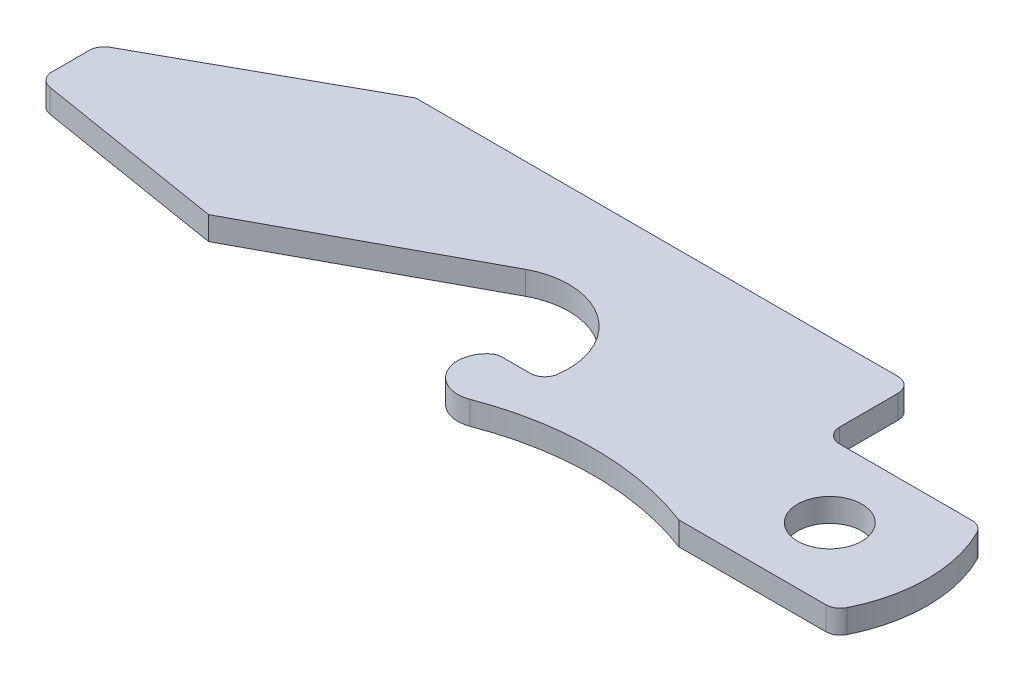
ISO-10303-21;
HEADER;
FILE_DESCRIPTION(('STEP AP214'),'2;1');
FILE_NAME('part.step','',(''),(''),'','','');
FILE_SCHEMA(('AUTOMOTIVE_DESIGN { 1 0 10303 214 1 1 1 1 }'));
ENDSEC;
DATA;
#1=APPLICATION_CONTEXT('core data for automotive mechanical design processes');
#2=APPLICATION_PROTOCOL_DEFINITION('international standard','automotive_design',2000,#1);
#3=PRODUCT_CONTEXT('',#1,'mechanical');
#4=PRODUCT('Part','Part','',(#3));
#5=PRODUCT_RELATED_PRODUCT_CATEGORY('part','',(#4));
#6=PRODUCT_DEFINITION_FORMATION('','',#4);
#7=PRODUCT_DEFINITION_CONTEXT('part definition',#1,'design');
#8=PRODUCT_DEFINITION('design','',#6,#7);
#9=PRODUCT_DEFINITION_SHAPE('','',#8);
#10=(LENGTH_UNIT() NAMED_UNIT(*) SI_UNIT(.MILLI.,.METRE.));
#11=(NAMED_UNIT(*) PLANE_ANGLE_UNIT() SI_UNIT($,.RADIAN.));
#12=(NAMED_UNIT(*) SI_UNIT($,.STERADIAN.) SOLID_ANGLE_UNIT());
#13=UNCERTAINTY_MEASURE_WITH_UNIT(LENGTH_MEASURE(1.E-05),#10,'distance_accuracy_value','');
#14=(GEOMETRIC_REPRESENTATION_CONTEXT(3) GLOBAL_UNCERTAINTY_ASSIGNED_CONTEXT((#13)) GLOBAL_UNIT_ASSIGNED_CONTEXT((#10,
#11,#12)) REPRESENTATION_CONTEXT('',''));
#15=CARTESIAN_POINT('',(0.,0.,0.));
#16=DIRECTION('',(0.,0.,1.));
#17=DIRECTION('',(1.,0.,0.));
#18=AXIS2_PLACEMENT_3D('',#15,#16,#17);
#19=CARTESIAN_POINT('',(19.2228019019053,1.016,1.93926605052077));
#20=DIRECTION('',(0.,-1.,0.));
#21=DIRECTION('',(0.,0.,-1.));
#22=AXIS2_PLACEMENT_3D('',#19,#20,#21);
#23=PLANE('',#22);
#24=DIRECTION('',(0.,0.,1.));
#25=VECTOR('',#24,1.);
#26=CARTESIAN_POINT('',(0.,1.016,0.));
#27=LINE('',#26,#25);
#28=CARTESIAN_POINT('',(0.,1.016,0.374379367879756));
#29=VERTEX_POINT('',#28);
#30=CARTESIAN_POINT('',(0.,1.016,2.00019421424728));
#31=VERTEX_POINT('',#30);
#32=EDGE_CURVE('E229',#29,#31,#27,.T.);
#33=ORIENTED_EDGE('',*,*,#32,.T.);
#34=CARTESIAN_POINT('',(0.635,1.016,2.00019421424728));
#35=DIRECTION('',(0.,-1.,0.));
#36=DIRECTION('',(0.,0.,-1.));
#37=AXIS2_PLACEMENT_3D('',#34,#35,#36);
#38=CIRCLE('',#37,0.635);
#39=CARTESIAN_POINT('',(0.532763489263101,1.016,2.62691001576527));
#40=VERTEX_POINT('',#39);
#41=EDGE_CURVE('E336',#31,#40,#38,.F.);
#42=ORIENTED_EDGE('',*,*,#41,.T.);
#43=DIRECTION('',(0.986954018138576,0.,0.161002379113226));
#44=VECTOR('',#43,1.);
#45=CARTESIAN_POINT('',(0.,1.016,2.54));
#46=LINE('',#45,#44);
#47=CARTESIAN_POINT('',(8.77402122125194,1.016,3.97131115031658));
#48=VERTEX_POINT('',#47);
#49=EDGE_CURVE('E233',#40,#48,#46,.T.);
#50=ORIENTED_EDGE('',*,*,#49,.T.);
#51=DIRECTION('',(0.879985795339902,0.,-0.475));
#52=VECTOR('',#51,1.);
#53=CARTESIAN_POINT('',(8.77402122125194,1.016,3.97131115031658));
#54=LINE('',#53,#52);
#55=CARTESIAN_POINT('',(17.7146769019053,1.016,-0.85468884968342));
#56=VERTEX_POINT('',#55);
#57=EDGE_CURVE('E235',#48,#56,#54,.T.);
#58=ORIENTED_EDGE('',*,*,#57,.T.);
#59=CARTESIAN_POINT('',(19.2228019019053,1.016,1.93926605052077));
#60=DIRECTION('',(0.,-1.,0.));
#61=DIRECTION('',(0.,0.,-1.));
#62=AXIS2_PLACEMENT_3D('',#59,#60,#61);
#63=CIRCLE('',#62,3.175);
#64=CARTESIAN_POINT('',(22.3618713878163,1.016,2.41557242526553));
#65=VERTEX_POINT('',#64);
#66=EDGE_CURVE('E237',#56,#65,#63,.T.);
#67=ORIENTED_EDGE('',*,*,#66,.T.);
#68=CARTESIAN_POINT('',(21.7340574906341,1.016,2.32031115031658));
#69=DIRECTION('',(0.,-1.,0.));
#70=DIRECTION('',(0.,0.,-1.));
#71=AXIS2_PLACEMENT_3D('',#68,#69,#70);
#72=CIRCLE('',#71,0.635);
#73=CARTESIAN_POINT('',(21.7340574906341,1.016,2.95531115031658));
#74=VERTEX_POINT('',#73);
#75=EDGE_CURVE('E376',#65,#74,#72,.T.);
#76=ORIENTED_EDGE('',*,*,#75,.T.);
#77=DIRECTION('',(-1.,0.,0.));
#78=VECTOR('',#77,1.);
#79=CARTESIAN_POINT('',(22.2308373663208,1.016,2.95531115031658));
#80=LINE('',#79,#78);
#81=CARTESIAN_POINT('',(20.5224710359564,1.016,2.95531115031658));
#82=VERTEX_POINT('',#81);
#83=EDGE_CURVE('E240',#74,#82,#80,.T.);
#84=ORIENTED_EDGE('',*,*,#83,.T.);
#85=CARTESIAN_POINT('',(20.5224710359564,1.016,3.59031115031658));
#86=DIRECTION('',(0.,-1.,0.));
#87=DIRECTION('',(0.,0.,-1.));
#88=AXIS2_PLACEMENT_3D('',#85,#86,#87);
#89=CIRCLE('',#88,0.635);
#90=CARTESIAN_POINT('',(20.0897713505508,1.016,3.12555747120273));
#91=VERTEX_POINT('',#90);
#92=EDGE_CURVE('E331',#82,#91,#89,.F.);
#93=ORIENTED_EDGE('',*,*,#92,.T.);
#94=CARTESIAN_POINT('',(20.9551707213621,1.016,4.05506482943046));
#95=DIRECTION('',(0.,1.,0.));
#96=DIRECTION('',(0.,0.,1.));
#97=AXIS2_PLACEMENT_3D('',#94,#95,#96);
#98=CIRCLE('',#97,1.27000000000003);
#99=CARTESIAN_POINT('',(21.4087340203449,1.016,5.24131115031661));
#100=VERTEX_POINT('',#99);
#101=EDGE_CURVE('E243',#91,#100,#98,.T.);
#102=ORIENTED_EDGE('',*,*,#101,.T.);
#103=CARTESIAN_POINT('',(25.9443670101724,1.016,17.1037743591779));
#104=DIRECTION('',(0.,-1.,0.));
#105=DIRECTION('',(0.,0.,-1.));
#106=AXIS2_PLACEMENT_3D('',#103,#104,#105);
#107=CIRCLE('',#106,12.7);
#108=CARTESIAN_POINT('',(30.48,1.016,5.24131115031659));
#109=VERTEX_POINT('',#108);
#110=EDGE_CURVE('E245',#100,#109,#107,.T.);
#111=ORIENTED_EDGE('',*,*,#110,.T.);
#112=DIRECTION('',(1.,0.,0.));
#113=VECTOR('',#112,1.);
#114=CARTESIAN_POINT('',(30.48,1.016,5.24131115031659));
#115=LINE('',#114,#113);
#116=CARTESIAN_POINT('',(36.8695336701696,1.016,5.24131115031658));
#117=VERTEX_POINT('',#116);
#118=EDGE_CURVE('E247',#109,#117,#115,.T.);
#119=ORIENTED_EDGE('',*,*,#118,.T.);
#120=CARTESIAN_POINT('',(36.8695336701696,1.016,4.60631115031658));
#121=DIRECTION('',(0.,-1.,0.));
#122=DIRECTION('',(0.,0.,-1.));
#123=AXIS2_PLACEMENT_3D('',#120,#121,#122);
#124=CIRCLE('',#123,0.635);
#125=CARTESIAN_POINT('',(37.4383707446329,1.016,4.8885333725388));
#126=VERTEX_POINT('',#125);
#127=EDGE_CURVE('E327',#117,#126,#124,.F.);
#128=ORIENTED_EDGE('',*,*,#127,.T.);
#129=CARTESIAN_POINT('',(31.75,1.016,2.06631115031658));
#130=DIRECTION('',(0.,1.,0.));
#131=DIRECTION('',(0.,0.,1.));
#132=AXIS2_PLACEMENT_3D('',#129,#130,#131);
#133=CIRCLE('',#132,6.35);
#134=CARTESIAN_POINT('',(37.4383707446329,1.016,-0.755911071905647));
#135=VERTEX_POINT('',#134);
#136=EDGE_CURVE('E250',#126,#135,#133,.T.);
#137=ORIENTED_EDGE('',*,*,#136,.T.);
#138=CARTESIAN_POINT('',(36.8695336701696,1.016,-0.473688849683422));
#139=DIRECTION('',(0.,-1.,0.));
#140=DIRECTION('',(0.,0.,-1.));
#141=AXIS2_PLACEMENT_3D('',#138,#139,#140);
#142=CIRCLE('',#141,0.635);
#143=CARTESIAN_POINT('',(36.8695336701696,1.016,-1.10868884968342));
#144=VERTEX_POINT('',#143);
#145=EDGE_CURVE('E329',#135,#144,#142,.F.);
#146=ORIENTED_EDGE('',*,*,#145,.T.);
#147=DIRECTION('',(-1.,0.,0.));
#148=VECTOR('',#147,1.);
#149=CARTESIAN_POINT('',(37.2492613140312,1.016,-1.10868884968342));
#150=LINE('',#149,#148);
#151=CARTESIAN_POINT('',(31.115,1.016,-1.10868884968342));
#152=VERTEX_POINT('',#151);
#153=EDGE_CURVE('E253',#144,#152,#150,.T.);
#154=ORIENTED_EDGE('',*,*,#153,.T.);
#155=CARTESIAN_POINT('',(31.115,1.016,-1.74368884968342));
#156=DIRECTION('',(0.,-1.,0.));
#157=DIRECTION('',(0.,0.,-1.));
#158=AXIS2_PLACEMENT_3D('',#155,#156,#157);
#159=CIRCLE('',#158,0.635);
#160=CARTESIAN_POINT('',(30.48,1.016,-1.74368884968342));
#161=VERTEX_POINT('',#160);
#162=EDGE_CURVE('E372',#152,#161,#159,.T.);
#163=ORIENTED_EDGE('',*,*,#162,.T.);
#164=DIRECTION('',(0.,0.,-1.));
#165=VECTOR('',#164,1.);
#166=CARTESIAN_POINT('',(30.48,1.016,-1.10868884968342));
#167=LINE('',#166,#165);
#168=CARTESIAN_POINT('',(30.48,1.016,-4.28368884968342));
#169=VERTEX_POINT('',#168);
#170=EDGE_CURVE('E256',#161,#169,#167,.T.);
#171=ORIENTED_EDGE('',*,*,#170,.T.);
#172=CARTESIAN_POINT('',(29.845,1.016,-4.28368884968342));
#173=DIRECTION('',(0.,-1.,0.));
#174=DIRECTION('',(0.,0.,-1.));
#175=AXIS2_PLACEMENT_3D('',#172,#173,#174);
#176=CIRCLE('',#175,0.635);
#177=CARTESIAN_POINT('',(29.845,1.016,-4.91868884968342));
#178=VERTEX_POINT('',#177);
#179=EDGE_CURVE('E61',#169,#178,#176,.F.);
#180=ORIENTED_EDGE('',*,*,#179,.T.);
#181=DIRECTION('',(-1.,0.,0.));
#182=VECTOR('',#181,1.);
#183=CARTESIAN_POINT('',(30.48,1.016,-4.91868884968342));
#184=LINE('',#183,#182);
#185=CARTESIAN_POINT('',(8.89,1.016,-4.91868884968342));
#186=VERTEX_POINT('',#185);
#187=EDGE_CURVE('E258',#178,#186,#184,.T.);
#188=ORIENTED_EDGE('',*,*,#187,.T.);
#189=DIRECTION('',(-0.875,0.,0.484122918275927));
#190=VECTOR('',#189,1.);
#191=CARTESIAN_POINT('',(8.89,1.016,-4.91868884968342));
#192=LINE('',#191,#190);
#193=CARTESIAN_POINT('',(0.327581946894787,1.016,-0.181245632120244));
#194=VERTEX_POINT('',#193);
#195=EDGE_CURVE('E226',#186,#194,#192,.T.);
#196=ORIENTED_EDGE('',*,*,#195,.T.);
#197=CARTESIAN_POINT('',(0.635,1.016,0.374379367879756));
#198=DIRECTION('',(0.,-1.,0.));
#199=DIRECTION('',(0.,0.,-1.));
#200=AXIS2_PLACEMENT_3D('',#197,#198,#199);
#201=CIRCLE('',#200,0.635);
#202=EDGE_CURVE('E334',#194,#29,#201,.F.);
#203=ORIENTED_EDGE('',*,*,#202,.T.);
#204=EDGE_LOOP('',(#33,#42,#50,#58,#67,#76,#84,#93,#102,#111,#119,#128,#137,#146,#154,#163,#171,
#180,#188,#196,#203));
#205=FACE_BOUND('',#204,.T.);
#206=CARTESIAN_POINT('',(33.8646306570156,1.016,2.06631115031658));
#207=DIRECTION('',(0.,1.,0.));
#208=DIRECTION('',(0.,0.,1.));
#209=AXIS2_PLACEMENT_3D('',#206,#207,#208);
#210=CIRCLE('',#209,1.39700000000001);
#211=CARTESIAN_POINT('',(33.8646306570156,1.016,3.46331115031659));
#212=VERTEX_POINT('',#211);
#213=EDGE_CURVE('E220',#212,#212,#210,.T.);
#214=ORIENTED_EDGE('',*,*,#213,.F.);
#215=EDGE_LOOP('',(#214));
#216=FACE_BOUND('',#215,.T.);
#217=ADVANCED_FACE('F38',(#205,#216),#23,.F.);
#218=CARTESIAN_POINT('',(19.2228019019053,0.,1.93926605052077));
#219=DIRECTION('',(0.,-1.,0.));
#220=DIRECTION('',(0.,0.,-1.));
#221=AXIS2_PLACEMENT_3D('',#218,#219,#220);
#222=PLANE('',#221);
#223=DIRECTION('',(1.,0.,0.));
#224=VECTOR('',#223,1.);
#225=CARTESIAN_POINT('',(19.2228019019053,0.,-3.79084647845915));
#226=LINE('',#225,#224);
#227=CARTESIAN_POINT('',(8.95441338846345,0.,-3.79084647845915));
#228=VERTEX_POINT('',#227);
#229=CARTESIAN_POINT('',(17.7155866115366,0.,-3.79084647845915));
#230=VERTEX_POINT('',#229);
#231=EDGE_CURVE('E11',#228,#230,#226,.T.);
#232=ORIENTED_EDGE('',*,*,#231,.F.);
#233=CARTESIAN_POINT('',(13.335,0.,-11.7668680196805));
#234=DIRECTION('',(0.,-1.,0.));
#235=DIRECTION('',(0.,0.,-1.));
#236=AXIS2_PLACEMENT_3D('',#233,#234,#235);
#237=ELLIPSE('',#236,9.13278678184386,8.99296896336681);
#238=CARTESIAN_POINT('',(12.0720083237881,0.,-2.7245972956057));
#239=VERTEX_POINT('',#238);
#240=EDGE_CURVE('E379',#239,#228,#237,.T.);
#241=ORIENTED_EDGE('',*,*,#240,.F.);
#242=DIRECTION('',(-1.,0.,0.));
#243=VECTOR('',#242,1.);
#244=CARTESIAN_POINT('',(19.2228019019053,0.,-2.7245972956057));
#245=LINE('',#244,#243);
#246=CARTESIAN_POINT('',(14.5979916762119,0.,-2.7245972956057));
#247=VERTEX_POINT('',#246);
#248=EDGE_CURVE('E378',#247,#239,#245,.T.);
#249=ORIENTED_EDGE('',*,*,#248,.F.);
#250=EDGE_CURVE('E46',#230,#247,#237,.T.);
#251=ORIENTED_EDGE('',*,*,#250,.F.);
#252=EDGE_LOOP('',(#232,#241,#249,#251));
#253=FACE_BOUND('',#252,.T.);
#254=DIRECTION('',(0.986954018138576,0.,0.161002379113226));
#255=VECTOR('',#254,1.);
#256=CARTESIAN_POINT('',(0.,0.,2.54));
#257=LINE('',#256,#255);
#258=CARTESIAN_POINT('',(0.532763489263101,0.,2.62691001576527));
#259=VERTEX_POINT('',#258);
#260=CARTESIAN_POINT('',(8.77402122125194,0.,3.97131115031658));
#261=VERTEX_POINT('',#260);
#262=EDGE_CURVE('E266',#259,#261,#257,.T.);
#263=ORIENTED_EDGE('',*,*,#262,.F.);
#264=CARTESIAN_POINT('',(0.635,0.,2.00019421424728));
#265=DIRECTION('',(0.,-1.,0.));
#266=DIRECTION('',(0.,0.,-1.));
#267=AXIS2_PLACEMENT_3D('',#264,#265,#266);
#268=CIRCLE('',#267,0.635);
#269=CARTESIAN_POINT('',(0.,0.,2.00019421424728));
#270=VERTEX_POINT('',#269);
#271=EDGE_CURVE('E320',#259,#270,#268,.T.);
#272=ORIENTED_EDGE('',*,*,#271,.T.);
#273=DIRECTION('',(0.,0.,1.));
#274=VECTOR('',#273,1.);
#275=CARTESIAN_POINT('',(0.,0.,0.));
#276=LINE('',#275,#274);
#277=CARTESIAN_POINT('',(0.,0.,0.374379367879756));
#278=VERTEX_POINT('',#277);
#279=EDGE_CURVE('E263',#278,#270,#276,.T.);
#280=ORIENTED_EDGE('',*,*,#279,.F.);
#281=CARTESIAN_POINT('',(0.635,0.,0.374379367879756));
#282=DIRECTION('',(0.,-1.,0.));
#283=DIRECTION('',(0.,0.,-1.));
#284=AXIS2_PLACEMENT_3D('',#281,#282,#283);
#285=CIRCLE('',#284,0.635);
#286=CARTESIAN_POINT('',(0.327581946894787,0.,-0.181245632120244));
#287=VERTEX_POINT('',#286);
#288=EDGE_CURVE('E318',#278,#287,#285,.T.);
#289=ORIENTED_EDGE('',*,*,#288,.T.);
#290=DIRECTION('',(-0.875,0.,0.484122918275927));
#291=VECTOR('',#290,1.);
#292=CARTESIAN_POINT('',(8.89,0.,-4.91868884968342));
#293=LINE('',#292,#291);
#294=CARTESIAN_POINT('',(8.89,0.,-4.91868884968342));
#295=VERTEX_POINT('',#294);
#296=EDGE_CURVE('E223',#295,#287,#293,.T.);
#297=ORIENTED_EDGE('',*,*,#296,.F.);
#298=DIRECTION('',(-1.,0.,0.));
#299=VECTOR('',#298,1.);
#300=CARTESIAN_POINT('',(30.48,0.,-4.91868884968342));
#301=LINE('',#300,#299);
#302=CARTESIAN_POINT('',(29.845,0.,-4.91868884968342));
#303=VERTEX_POINT('',#302);
#304=EDGE_CURVE('E230',#303,#295,#301,.T.);
#305=ORIENTED_EDGE('',*,*,#304,.F.);
#306=CARTESIAN_POINT('',(29.845,0.,-4.28368884968342));
#307=DIRECTION('',(0.,-1.,0.));
#308=DIRECTION('',(0.,0.,-1.));
#309=AXIS2_PLACEMENT_3D('',#306,#307,#308);
#310=CIRCLE('',#309,0.635);
#311=CARTESIAN_POINT('',(30.48,0.,-4.28368884968342));
#312=VERTEX_POINT('',#311);
#313=EDGE_CURVE('E316',#303,#312,#310,.T.);
#314=ORIENTED_EDGE('',*,*,#313,.T.);
#315=DIRECTION('',(0.,0.,-1.));
#316=VECTOR('',#315,1.);
#317=CARTESIAN_POINT('',(30.48,0.,-1.10868884968342));
#318=LINE('',#317,#316);
#319=CARTESIAN_POINT('',(30.48,0.,-1.74368884968342));
#320=VERTEX_POINT('',#319);
#321=EDGE_CURVE('E289',#320,#312,#318,.T.);
#322=ORIENTED_EDGE('',*,*,#321,.F.);
#323=CARTESIAN_POINT('',(31.115,0.,-1.74368884968342));
#324=DIRECTION('',(0.,-1.,0.));
#325=DIRECTION('',(0.,0.,-1.));
#326=AXIS2_PLACEMENT_3D('',#323,#324,#325);
#327=CIRCLE('',#326,0.635);
#328=CARTESIAN_POINT('',(31.115,0.,-1.10868884968342));
#329=VERTEX_POINT('',#328);
#330=EDGE_CURVE('E370',#320,#329,#327,.F.);
#331=ORIENTED_EDGE('',*,*,#330,.T.);
#332=DIRECTION('',(-1.,0.,0.));
#333=VECTOR('',#332,1.);
#334=CARTESIAN_POINT('',(37.2492613140312,0.,-1.10868884968342));
#335=LINE('',#334,#333);
#336=CARTESIAN_POINT('',(36.8695336701696,0.,-1.10868884968342));
#337=VERTEX_POINT('',#336);
#338=EDGE_CURVE('E286',#337,#329,#335,.T.);
#339=ORIENTED_EDGE('',*,*,#338,.F.);
#340=CARTESIAN_POINT('',(36.8695336701696,0.,-0.473688849683422));
#341=DIRECTION('',(0.,-1.,0.));
#342=DIRECTION('',(0.,0.,-1.));
#343=AXIS2_PLACEMENT_3D('',#340,#341,#342);
#344=CIRCLE('',#343,0.635);
#345=CARTESIAN_POINT('',(37.4383707446329,0.,-0.755911071905647));
#346=VERTEX_POINT('',#345);
#347=EDGE_CURVE('E312',#337,#346,#344,.T.);
#348=ORIENTED_EDGE('',*,*,#347,.T.);
#349=CARTESIAN_POINT('',(31.75,0.,2.06631115031658));
#350=DIRECTION('',(0.,1.,0.));
#351=DIRECTION('',(0.,0.,1.));
#352=AXIS2_PLACEMENT_3D('',#349,#350,#351);
#353=CIRCLE('',#352,6.35);
#354=CARTESIAN_POINT('',(37.4383707446329,0.,4.8885333725388));
#355=VERTEX_POINT('',#354);
#356=EDGE_CURVE('E283',#355,#346,#353,.T.);
#357=ORIENTED_EDGE('',*,*,#356,.F.);
#358=CARTESIAN_POINT('',(36.8695336701696,0.,4.60631115031658));
#359=DIRECTION('',(0.,-1.,0.));
#360=DIRECTION('',(0.,0.,-1.));
#361=AXIS2_PLACEMENT_3D('',#358,#359,#360);
#362=CIRCLE('',#361,0.635);
#363=CARTESIAN_POINT('',(36.8695336701696,0.,5.24131115031658));
#364=VERTEX_POINT('',#363);
#365=EDGE_CURVE('E310',#355,#364,#362,.T.);
#366=ORIENTED_EDGE('',*,*,#365,.T.);
#367=DIRECTION('',(1.,0.,0.));
#368=VECTOR('',#367,1.);
#369=CARTESIAN_POINT('',(30.48,0.,5.24131115031659));
#370=LINE('',#369,#368);
#371=CARTESIAN_POINT('',(30.48,0.,5.24131115031659));
#372=VERTEX_POINT('',#371);
#373=EDGE_CURVE('E280',#372,#364,#370,.T.);
#374=ORIENTED_EDGE('',*,*,#373,.F.);
#375=CARTESIAN_POINT('',(25.9443670101724,0.,17.1037743591779));
#376=DIRECTION('',(0.,-1.,0.));
#377=DIRECTION('',(0.,0.,-1.));
#378=AXIS2_PLACEMENT_3D('',#375,#376,#377);
#379=CIRCLE('',#378,12.7);
#380=CARTESIAN_POINT('',(21.4087340203449,0.,5.24131115031661));
#381=VERTEX_POINT('',#380);
#382=EDGE_CURVE('E278',#381,#372,#379,.T.);
#383=ORIENTED_EDGE('',*,*,#382,.F.);
#384=CARTESIAN_POINT('',(20.9551707213621,0.,4.05506482943046));
#385=DIRECTION('',(0.,1.,0.));
#386=DIRECTION('',(0.,0.,1.));
#387=AXIS2_PLACEMENT_3D('',#384,#385,#386);
#388=CIRCLE('',#387,1.27000000000003);
#389=CARTESIAN_POINT('',(20.0897713505508,0.,3.12555747120273));
#390=VERTEX_POINT('',#389);
#391=EDGE_CURVE('E276',#390,#381,#388,.T.);
#392=ORIENTED_EDGE('',*,*,#391,.F.);
#393=CARTESIAN_POINT('',(20.5224710359564,0.,3.59031115031658));
#394=DIRECTION('',(0.,-1.,0.));
#395=DIRECTION('',(0.,0.,-1.));
#396=AXIS2_PLACEMENT_3D('',#393,#394,#395);
#397=CIRCLE('',#396,0.635);
#398=CARTESIAN_POINT('',(20.5224710359564,0.,2.95531115031658));
#399=VERTEX_POINT('',#398);
#400=EDGE_CURVE('E314',#390,#399,#397,.T.);
#401=ORIENTED_EDGE('',*,*,#400,.T.);
#402=DIRECTION('',(-1.,0.,0.));
#403=VECTOR('',#402,1.);
#404=CARTESIAN_POINT('',(22.2308373663208,0.,2.95531115031658));
#405=LINE('',#404,#403);
#406=CARTESIAN_POINT('',(21.7340574906341,0.,2.95531115031658));
#407=VERTEX_POINT('',#406);
#408=EDGE_CURVE('E273',#407,#399,#405,.T.);
#409=ORIENTED_EDGE('',*,*,#408,.F.);
#410=CARTESIAN_POINT('',(21.7340574906341,0.,2.32031115031658));
#411=DIRECTION('',(0.,-1.,0.));
#412=DIRECTION('',(0.,0.,-1.));
#413=AXIS2_PLACEMENT_3D('',#410,#411,#412);
#414=CIRCLE('',#413,0.635);
#415=CARTESIAN_POINT('',(22.3618713878163,0.,2.41557242526553));
#416=VERTEX_POINT('',#415);
#417=EDGE_CURVE('E374',#407,#416,#414,.F.);
#418=ORIENTED_EDGE('',*,*,#417,.T.);
#419=CARTESIAN_POINT('',(19.2228019019053,0.,1.93926605052077));
#420=DIRECTION('',(0.,-1.,0.));
#421=DIRECTION('',(0.,0.,-1.));
#422=AXIS2_PLACEMENT_3D('',#419,#420,#421);
#423=CIRCLE('',#422,3.175);
#424=CARTESIAN_POINT('',(17.7146769019053,0.,-0.85468884968342));
#425=VERTEX_POINT('',#424);
#426=EDGE_CURVE('E270',#425,#416,#423,.T.);
#427=ORIENTED_EDGE('',*,*,#426,.F.);
#428=DIRECTION('',(0.879985795339902,0.,-0.475));
#429=VECTOR('',#428,1.);
#430=CARTESIAN_POINT('',(8.77402122125194,0.,3.97131115031658));
#431=LINE('',#430,#429);
#432=EDGE_CURVE('E268',#261,#425,#431,.T.);
#433=ORIENTED_EDGE('',*,*,#432,.F.);
#434=EDGE_LOOP('',(#263,#272,#280,#289,#297,#305,#314,#322,#331,#339,#348,#357,#366,#374,#383,
#392,#401,#409,#418,#427,#433));
#435=FACE_BOUND('',#434,.T.);
#436=CARTESIAN_POINT('',(33.8646306570156,0.,2.06631115031658));
#437=DIRECTION('',(0.,1.,0.));
#438=DIRECTION('',(0.,0.,1.));
#439=AXIS2_PLACEMENT_3D('',#436,#437,#438);
#440=CIRCLE('',#439,1.39700000000001);
#441=CARTESIAN_POINT('',(33.8646306570156,0.,3.46331115031659));
#442=VERTEX_POINT('',#441);
#443=EDGE_CURVE('E207',#442,#442,#440,.T.);
#444=ORIENTED_EDGE('',*,*,#443,.T.);
#445=EDGE_LOOP('',(#444));
#446=FACE_BOUND('',#445,.T.);
#447=ADVANCED_FACE('F384',(#253,#435,#446),#222,.T.);
#448=CARTESIAN_POINT('',(8.89,1.016,-4.91868884968342));
#449=DIRECTION('',(0.484122918275927,0.,0.875));
#450=DIRECTION('',(0.875,0.,-0.484122918275927));
#451=AXIS2_PLACEMENT_3D('',#448,#449,#450);
#452=PLANE('',#451);
#453=ORIENTED_EDGE('',*,*,#296,.T.);
#454=DIRECTION('',(0.,-1.,0.));
#455=VECTOR('',#454,1.);
#456=CARTESIAN_POINT('',(0.327581946894787,1.016,-0.181245632120245));
#457=LINE('',#456,#455);
#458=EDGE_CURVE('E338',#287,#194,#457,.F.);
#459=ORIENTED_EDGE('',*,*,#458,.T.);
#460=ORIENTED_EDGE('',*,*,#195,.F.);
#461=DIRECTION('',(0.,-1.,0.));
#462=VECTOR('',#461,1.);
#463=CARTESIAN_POINT('',(8.89,1.016,-4.91868884968342));
#464=LINE('',#463,#462);
#465=EDGE_CURVE('E260',#186,#295,#464,.T.);
#466=ORIENTED_EDGE('',*,*,#465,.T.);
#467=EDGE_LOOP('',(#453,#459,#460,#466));
#468=FACE_BOUND('',#467,.T.);
#469=ADVANCED_FACE('F387',(#468),#452,.F.);
#470=CARTESIAN_POINT('',(0.,1.016,0.));
#471=DIRECTION('',(1.,0.,0.));
#472=DIRECTION('',(0.,0.,-1.));
#473=AXIS2_PLACEMENT_3D('',#470,#471,#472);
#474=PLANE('',#473);
#475=ORIENTED_EDGE('',*,*,#279,.T.);
#476=DIRECTION('',(0.,-1.,0.));
#477=VECTOR('',#476,1.);
#478=CARTESIAN_POINT('',(0.,1.016,2.00019421424728));
#479=LINE('',#478,#477);
#480=EDGE_CURVE('E325',#270,#31,#479,.F.);
#481=ORIENTED_EDGE('',*,*,#480,.T.);
#482=ORIENTED_EDGE('',*,*,#32,.F.);
#483=DIRECTION('',(0.,-1.,0.));
#484=VECTOR('',#483,1.);
#485=CARTESIAN_POINT('',(0.,1.016,0.374379367879756));
#486=LINE('',#485,#484);
#487=EDGE_CURVE('E322',#29,#278,#486,.T.);
#488=ORIENTED_EDGE('',*,*,#487,.T.);
#489=EDGE_LOOP('',(#475,#481,#482,#488));
#490=FACE_BOUND('',#489,.T.);
#491=ADVANCED_FACE('F455',(#490),#474,.F.);
#492=CARTESIAN_POINT('',(0.,1.016,2.54));
#493=DIRECTION('',(0.161002379113226,0.,-0.986954018138576));
#494=DIRECTION('',(-0.986954018138576,0.,-0.161002379113226));
#495=AXIS2_PLACEMENT_3D('',#492,#493,#494);
#496=PLANE('',#495);
#497=ORIENTED_EDGE('',*,*,#49,.F.);
#498=DIRECTION('',(0.,-1.,0.));
#499=VECTOR('',#498,1.);
#500=CARTESIAN_POINT('',(0.532763489263101,1.016,2.62691001576527));
#501=LINE('',#500,#499);
#502=EDGE_CURVE('E307',#40,#259,#501,.T.);
#503=ORIENTED_EDGE('',*,*,#502,.T.);
#504=ORIENTED_EDGE('',*,*,#262,.T.);
#505=DIRECTION('',(0.,-1.,0.));
#506=VECTOR('',#505,1.);
#507=CARTESIAN_POINT('',(8.77402122125194,1.016,3.97131115031658));
#508=LINE('',#507,#506);
#509=EDGE_CURVE('E304',#48,#261,#508,.T.);
#510=ORIENTED_EDGE('',*,*,#509,.F.);
#511=EDGE_LOOP('',(#497,#503,#504,#510));
#512=FACE_BOUND('',#511,.T.);
#513=ADVANCED_FACE('F451',(#512),#496,.F.);
#514=CARTESIAN_POINT('',(8.77402122125194,1.016,3.97131115031658));
#515=DIRECTION('',(-0.475,0.,-0.879985795339902));
#516=DIRECTION('',(-0.879985795339902,0.,0.475));
#517=AXIS2_PLACEMENT_3D('',#514,#515,#516);
#518=PLANE('',#517);
#519=ORIENTED_EDGE('',*,*,#432,.T.);
#520=DIRECTION('',(0.,-1.,0.));
#521=VECTOR('',#520,1.);
#522=CARTESIAN_POINT('',(17.7146769019053,1.016,-0.85468884968342));
#523=LINE('',#522,#521);
#524=EDGE_CURVE('E301',#56,#425,#523,.T.);
#525=ORIENTED_EDGE('',*,*,#524,.F.);
#526=ORIENTED_EDGE('',*,*,#57,.F.);
#527=ORIENTED_EDGE('',*,*,#509,.T.);
#528=EDGE_LOOP('',(#519,#525,#526,#527));
#529=FACE_BOUND('',#528,.T.);
#530=ADVANCED_FACE('F447',(#529),#518,.F.);
#531=CARTESIAN_POINT('',(19.2228019019053,1.016,1.93926605052077));
#532=DIRECTION('',(0.,-1.,0.));
#533=DIRECTION('',(0.,0.,-1.));
#534=AXIS2_PLACEMENT_3D('',#531,#532,#533);
#535=CYLINDRICAL_SURFACE('',#534,3.175);
#536=ORIENTED_EDGE('',*,*,#426,.T.);
#537=DIRECTION('',(0.,-1.,0.));
#538=VECTOR('',#537,1.);
#539=CARTESIAN_POINT('',(22.3618713878163,1.016,2.41557242526553));
#540=LINE('',#539,#538);
#541=EDGE_CURVE('E361',#416,#65,#540,.F.);
#542=ORIENTED_EDGE('',*,*,#541,.T.);
#543=ORIENTED_EDGE('',*,*,#66,.F.);
#544=ORIENTED_EDGE('',*,*,#524,.T.);
#545=EDGE_LOOP('',(#536,#542,#543,#544));
#546=FACE_BOUND('',#545,.T.);
#547=ADVANCED_FACE('F443',(#546),#535,.F.);
#548=CARTESIAN_POINT('',(22.2308373663208,1.016,2.95531115031658));
#549=DIRECTION('',(0.,0.,1.));
#550=DIRECTION('',(1.,0.,0.));
#551=AXIS2_PLACEMENT_3D('',#548,#549,#550);
#552=PLANE('',#551);
#553=ORIENTED_EDGE('',*,*,#408,.T.);
#554=DIRECTION('',(0.,-1.,0.));
#555=VECTOR('',#554,1.);
#556=CARTESIAN_POINT('',(20.5224710359564,1.016,2.95531115031658));
#557=LINE('',#556,#555);
#558=EDGE_CURVE('E359',#399,#82,#557,.F.);
#559=ORIENTED_EDGE('',*,*,#558,.T.);
#560=ORIENTED_EDGE('',*,*,#83,.F.);
#561=DIRECTION('',(0.,1.,0.));
#562=VECTOR('',#561,1.);
#563=CARTESIAN_POINT('',(21.7340574906341,0.,2.95531115031658));
#564=LINE('',#563,#562);
#565=EDGE_CURVE('E356',#74,#407,#564,.F.);
#566=ORIENTED_EDGE('',*,*,#565,.T.);
#567=EDGE_LOOP('',(#553,#559,#560,#566));
#568=FACE_BOUND('',#567,.T.);
#569=ADVANCED_FACE('F439',(#568),#552,.F.);
#570=CARTESIAN_POINT('',(20.9551707213621,1.016,4.05506482943046));
#571=DIRECTION('',(0.,-1.,0.));
#572=DIRECTION('',(0.,0.,-1.));
#573=AXIS2_PLACEMENT_3D('',#570,#571,#572);
#574=CYLINDRICAL_SURFACE('',#573,1.27000000000003);
#575=ORIENTED_EDGE('',*,*,#101,.F.);
#576=DIRECTION('',(0.,-1.,0.));
#577=VECTOR('',#576,1.);
#578=CARTESIAN_POINT('',(20.0897713505508,1.016,3.12555747120273));
#579=LINE('',#578,#577);
#580=EDGE_CURVE('E353',#91,#390,#579,.T.);
#581=ORIENTED_EDGE('',*,*,#580,.T.);
#582=ORIENTED_EDGE('',*,*,#391,.T.);
#583=DIRECTION('',(0.,-1.,0.));
#584=VECTOR('',#583,1.);
#585=CARTESIAN_POINT('',(21.4087340203449,1.016,5.24131115031661));
#586=LINE('',#585,#584);
#587=EDGE_CURVE('E298',#100,#381,#586,.T.);
#588=ORIENTED_EDGE('',*,*,#587,.F.);
#589=EDGE_LOOP('',(#575,#581,#582,#588));
#590=FACE_BOUND('',#589,.T.);
#591=ADVANCED_FACE('F435',(#590),#574,.T.);
#592=CARTESIAN_POINT('',(25.9443670101724,1.016,17.1037743591779));
#593=DIRECTION('',(0.,-1.,0.));
#594=DIRECTION('',(0.,0.,-1.));
#595=AXIS2_PLACEMENT_3D('',#592,#593,#594);
#596=CYLINDRICAL_SURFACE('',#595,12.7);
#597=ORIENTED_EDGE('',*,*,#382,.T.);
#598=DIRECTION('',(0.,-1.,0.));
#599=VECTOR('',#598,1.);
#600=CARTESIAN_POINT('',(30.48,1.016,5.24131115031659));
#601=LINE('',#600,#599);
#602=EDGE_CURVE('E295',#109,#372,#601,.T.);
#603=ORIENTED_EDGE('',*,*,#602,.F.);
#604=ORIENTED_EDGE('',*,*,#110,.F.);
#605=ORIENTED_EDGE('',*,*,#587,.T.);
#606=EDGE_LOOP('',(#597,#603,#604,#605));
#607=FACE_BOUND('',#606,.T.);
#608=ADVANCED_FACE('F431',(#607),#596,.F.);
#609=CARTESIAN_POINT('',(30.48,1.016,5.24131115031659));
#610=DIRECTION('',(0.,0.,-1.));
#611=DIRECTION('',(-1.,0.,0.));
#612=AXIS2_PLACEMENT_3D('',#609,#610,#611);
#613=PLANE('',#612);
#614=ORIENTED_EDGE('',*,*,#373,.T.);
#615=DIRECTION('',(0.,-1.,0.));
#616=VECTOR('',#615,1.);
#617=CARTESIAN_POINT('',(36.8695336701696,1.016,5.24131115031658));
#618=LINE('',#617,#616);
#619=EDGE_CURVE('E368',#364,#117,#618,.F.);
#620=ORIENTED_EDGE('',*,*,#619,.T.);
#621=ORIENTED_EDGE('',*,*,#118,.F.);
#622=ORIENTED_EDGE('',*,*,#602,.T.);
#623=EDGE_LOOP('',(#614,#620,#621,#622));
#624=FACE_BOUND('',#623,.T.);
#625=ADVANCED_FACE('F427',(#624),#613,.F.);
#626=CARTESIAN_POINT('',(31.75,1.016,2.06631115031658));
#627=DIRECTION('',(0.,-1.,0.));
#628=DIRECTION('',(0.,0.,-1.));
#629=AXIS2_PLACEMENT_3D('',#626,#627,#628);
#630=CYLINDRICAL_SURFACE('',#629,6.35);
#631=ORIENTED_EDGE('',*,*,#356,.T.);
#632=DIRECTION('',(0.,-1.,0.));
#633=VECTOR('',#632,1.);
#634=CARTESIAN_POINT('',(37.4383707446329,1.016,-0.755911071905647));
#635=LINE('',#634,#633);
#636=EDGE_CURVE('E366',#346,#135,#635,.F.);
#637=ORIENTED_EDGE('',*,*,#636,.T.);
#638=ORIENTED_EDGE('',*,*,#136,.F.);
#639=DIRECTION('',(0.,-1.,0.));
#640=VECTOR('',#639,1.);
#641=CARTESIAN_POINT('',(37.4383707446329,1.016,4.8885333725388));
#642=LINE('',#641,#640);
#643=EDGE_CURVE('E363',#126,#355,#642,.T.);
#644=ORIENTED_EDGE('',*,*,#643,.T.);
#645=EDGE_LOOP('',(#631,#637,#638,#644));
#646=FACE_BOUND('',#645,.T.);
#647=ADVANCED_FACE('F423',(#646),#630,.T.);
#648=CARTESIAN_POINT('',(37.2492613140312,1.016,-1.10868884968342));
#649=DIRECTION('',(0.,0.,1.));
#650=DIRECTION('',(1.,0.,0.));
#651=AXIS2_PLACEMENT_3D('',#648,#649,#650);
#652=PLANE('',#651);
#653=ORIENTED_EDGE('',*,*,#338,.T.);
#654=DIRECTION('',(0.,-1.,0.));
#655=VECTOR('',#654,1.);
#656=CARTESIAN_POINT('',(31.115,1.016,-1.10868884968342));
#657=LINE('',#656,#655);
#658=EDGE_CURVE('E351',#329,#152,#657,.F.);
#659=ORIENTED_EDGE('',*,*,#658,.T.);
#660=ORIENTED_EDGE('',*,*,#153,.F.);
#661=DIRECTION('',(0.,-1.,0.));
#662=VECTOR('',#661,1.);
#663=CARTESIAN_POINT('',(36.8695336701696,1.016,-1.10868884968342));
#664=LINE('',#663,#662);
#665=EDGE_CURVE('E348',#144,#337,#664,.T.);
#666=ORIENTED_EDGE('',*,*,#665,.T.);
#667=EDGE_LOOP('',(#653,#659,#660,#666));
#668=FACE_BOUND('',#667,.T.);
#669=ADVANCED_FACE('F419',(#668),#652,.F.);
#670=CARTESIAN_POINT('',(30.48,1.016,-1.10868884968342));
#671=DIRECTION('',(-1.,0.,0.));
#672=DIRECTION('',(0.,0.,1.));
#673=AXIS2_PLACEMENT_3D('',#670,#671,#672);
#674=PLANE('',#673);
#675=ORIENTED_EDGE('',*,*,#321,.T.);
#676=DIRECTION('',(0.,-1.,0.));
#677=VECTOR('',#676,1.);
#678=CARTESIAN_POINT('',(30.48,1.016,-4.28368884968342));
#679=LINE('',#678,#677);
#680=EDGE_CURVE('E346',#312,#169,#679,.F.);
#681=ORIENTED_EDGE('',*,*,#680,.T.);
#682=ORIENTED_EDGE('',*,*,#170,.F.);
#683=DIRECTION('',(0.,-1.,0.));
#684=VECTOR('',#683,1.);
#685=CARTESIAN_POINT('',(30.48,0.,-1.74368884968342));
#686=LINE('',#685,#684);
#687=EDGE_CURVE('E343',#161,#320,#686,.T.);
#688=ORIENTED_EDGE('',*,*,#687,.T.);
#689=EDGE_LOOP('',(#675,#681,#682,#688));
#690=FACE_BOUND('',#689,.T.);
#691=ADVANCED_FACE('F407',(#690),#674,.F.);
#692=CARTESIAN_POINT('',(30.48,1.016,-4.91868884968342));
#693=DIRECTION('',(0.,0.,1.));
#694=DIRECTION('',(1.,0.,0.));
#695=AXIS2_PLACEMENT_3D('',#692,#693,#694);
#696=PLANE('',#695);
#697=ORIENTED_EDGE('',*,*,#187,.F.);
#698=DIRECTION('',(0.,-1.,0.));
#699=VECTOR('',#698,1.);
#700=CARTESIAN_POINT('',(29.845,1.016,-4.91868884968342));
#701=LINE('',#700,#699);
#702=EDGE_CURVE('E340',#178,#303,#701,.T.);
#703=ORIENTED_EDGE('',*,*,#702,.T.);
#704=ORIENTED_EDGE('',*,*,#304,.T.);
#705=ORIENTED_EDGE('',*,*,#465,.F.);
#706=EDGE_LOOP('',(#697,#703,#704,#705));
#707=FACE_BOUND('',#706,.T.);
#708=ADVANCED_FACE('F397',(#707),#696,.F.);
#709=CARTESIAN_POINT('',(33.8646306570156,1.016,2.06631115031658));
#710=DIRECTION('',(0.,-1.,0.));
#711=DIRECTION('',(0.,0.,-1.));
#712=AXIS2_PLACEMENT_3D('',#709,#710,#711);
#713=CYLINDRICAL_SURFACE('',#712,1.39700000000001);
#714=ORIENTED_EDGE('',*,*,#213,.T.);
#715=EDGE_LOOP('',(#714));
#716=FACE_BOUND('',#715,.T.);
#717=ORIENTED_EDGE('',*,*,#443,.F.);
#718=EDGE_LOOP('',(#717));
#719=FACE_BOUND('',#718,.T.);
#720=ADVANCED_FACE('F394',(#716,#719),#713,.F.);
#721=CARTESIAN_POINT('',(0.635,1.016,2.00019421424728));
#722=DIRECTION('',(0.,-1.,0.));
#723=DIRECTION('',(0.,0.,-1.));
#724=AXIS2_PLACEMENT_3D('',#721,#722,#723);
#725=CYLINDRICAL_SURFACE('',#724,0.635);
#726=ORIENTED_EDGE('',*,*,#41,.F.);
#727=ORIENTED_EDGE('',*,*,#480,.F.);
#728=ORIENTED_EDGE('',*,*,#271,.F.);
#729=ORIENTED_EDGE('',*,*,#502,.F.);
#730=EDGE_LOOP('',(#726,#727,#728,#729));
#731=FACE_BOUND('',#730,.T.);
#732=ADVANCED_FACE('F396',(#731),#725,.T.);
#733=CARTESIAN_POINT('',(0.635,1.016,0.374379367879756));
#734=DIRECTION('',(0.,-1.,0.));
#735=DIRECTION('',(0.,0.,-1.));
#736=AXIS2_PLACEMENT_3D('',#733,#734,#735);
#737=CYLINDRICAL_SURFACE('',#736,0.635);
#738=ORIENTED_EDGE('',*,*,#202,.F.);
#739=ORIENTED_EDGE('',*,*,#458,.F.);
#740=ORIENTED_EDGE('',*,*,#288,.F.);
#741=ORIENTED_EDGE('',*,*,#487,.F.);
#742=EDGE_LOOP('',(#738,#739,#740,#741));
#743=FACE_BOUND('',#742,.T.);
#744=ADVANCED_FACE('F404',(#743),#737,.T.);
#745=CARTESIAN_POINT('',(29.845,1.016,-4.28368884968342));
#746=DIRECTION('',(0.,-1.,0.));
#747=DIRECTION('',(0.,0.,-1.));
#748=AXIS2_PLACEMENT_3D('',#745,#746,#747);
#749=CYLINDRICAL_SURFACE('',#748,0.635);
#750=ORIENTED_EDGE('',*,*,#179,.F.);
#751=ORIENTED_EDGE('',*,*,#680,.F.);
#752=ORIENTED_EDGE('',*,*,#313,.F.);
#753=ORIENTED_EDGE('',*,*,#702,.F.);
#754=EDGE_LOOP('',(#750,#751,#752,#753));
#755=FACE_BOUND('',#754,.T.);
#756=ADVANCED_FACE('F465',(#755),#749,.T.);
#757=CARTESIAN_POINT('',(31.115,1.016,-1.74368884968342));
#758=DIRECTION('',(0.,1.,0.));
#759=DIRECTION('',(0.,0.,1.));
#760=AXIS2_PLACEMENT_3D('',#757,#758,#759);
#761=CYLINDRICAL_SURFACE('',#760,0.635);
#762=ORIENTED_EDGE('',*,*,#162,.F.);
#763=ORIENTED_EDGE('',*,*,#658,.F.);
#764=ORIENTED_EDGE('',*,*,#330,.F.);
#765=ORIENTED_EDGE('',*,*,#687,.F.);
#766=EDGE_LOOP('',(#762,#763,#764,#765));
#767=FACE_BOUND('',#766,.T.);
#768=ADVANCED_FACE('F469',(#767),#761,.F.);
#769=CARTESIAN_POINT('',(20.5224710359564,1.016,3.59031115031658));
#770=DIRECTION('',(0.,-1.,0.));
#771=DIRECTION('',(0.,0.,-1.));
#772=AXIS2_PLACEMENT_3D('',#769,#770,#771);
#773=CYLINDRICAL_SURFACE('',#772,0.635);
#774=ORIENTED_EDGE('',*,*,#92,.F.);
#775=ORIENTED_EDGE('',*,*,#558,.F.);
#776=ORIENTED_EDGE('',*,*,#400,.F.);
#777=ORIENTED_EDGE('',*,*,#580,.F.);
#778=EDGE_LOOP('',(#774,#775,#776,#777));
#779=FACE_BOUND('',#778,.T.);
#780=ADVANCED_FACE('F473',(#779),#773,.T.);
#781=CARTESIAN_POINT('',(21.7340574906341,1.016,2.32031115031658));
#782=DIRECTION('',(0.,-1.,0.));
#783=DIRECTION('',(0.,0.,-1.));
#784=AXIS2_PLACEMENT_3D('',#781,#782,#783);
#785=CYLINDRICAL_SURFACE('',#784,0.635);
#786=ORIENTED_EDGE('',*,*,#75,.F.);
#787=ORIENTED_EDGE('',*,*,#541,.F.);
#788=ORIENTED_EDGE('',*,*,#417,.F.);
#789=ORIENTED_EDGE('',*,*,#565,.F.);
#790=EDGE_LOOP('',(#786,#787,#788,#789));
#791=FACE_BOUND('',#790,.T.);
#792=ADVANCED_FACE('F477',(#791),#785,.F.);
#793=CARTESIAN_POINT('',(36.8695336701696,1.016,-0.473688849683422));
#794=DIRECTION('',(0.,-1.,0.));
#795=DIRECTION('',(0.,0.,-1.));
#796=AXIS2_PLACEMENT_3D('',#793,#794,#795);
#797=CYLINDRICAL_SURFACE('',#796,0.635);
#798=ORIENTED_EDGE('',*,*,#145,.F.);
#799=ORIENTED_EDGE('',*,*,#636,.F.);
#800=ORIENTED_EDGE('',*,*,#347,.F.);
#801=ORIENTED_EDGE('',*,*,#665,.F.);
#802=EDGE_LOOP('',(#798,#799,#800,#801));
#803=FACE_BOUND('',#802,.T.);
#804=ADVANCED_FACE('F480',(#803),#797,.T.);
#805=CARTESIAN_POINT('',(36.8695336701696,1.016,4.60631115031658));
#806=DIRECTION('',(0.,-1.,0.));
#807=DIRECTION('',(0.,0.,-1.));
#808=AXIS2_PLACEMENT_3D('',#805,#806,#807);
#809=CYLINDRICAL_SURFACE('',#808,0.635);
#810=ORIENTED_EDGE('',*,*,#127,.F.);
#811=ORIENTED_EDGE('',*,*,#619,.F.);
#812=ORIENTED_EDGE('',*,*,#365,.F.);
#813=ORIENTED_EDGE('',*,*,#643,.F.);
#814=EDGE_LOOP('',(#810,#811,#812,#813));
#815=FACE_BOUND('',#814,.T.);
#816=ADVANCED_FACE('F40',(#815),#809,.T.);
#817=CARTESIAN_POINT('',(13.335,1.14701435097783,-11.4237304852246));
#818=DIRECTION('',(0.,-0.984807753012208,-0.173648177666931));
#819=DIRECTION('',(0.,-0.173648177666931,0.984807753012208));
#820=AXIS2_PLACEMENT_3D('',#817,#818,#819);
#821=CONICAL_SURFACE('',#820,8.89,0.0872664625997167);
#822=ORIENTED_EDGE('',*,*,#250,.T.);
#823=CARTESIAN_POINT('',(13.335,1.52222610487548,-11.3575705295335));
#824=DIRECTION('',(0.,0.984807753012208,0.173648177666931));
#825=DIRECTION('',(0.,-0.173648177666931,0.984807753012208));
#826=AXIS2_PLACEMENT_3D('',#823,#824,#825);
#827=CIRCLE('',#826,8.85666681919662);
#828=CARTESIAN_POINT('',(17.6538075906033,0.179526470799059,-3.74274250558853));
#829=VERTEX_POINT('',#828);
#830=EDGE_CURVE('E53',#829,#247,#827,.F.);
#831=ORIENTED_EDGE('',*,*,#830,.F.);
#832=CARTESIAN_POINT('',(17.6538075906033,0.179526470799059,-3.74274250558853));
#833=CARTESIAN_POINT('',(17.6751127603145,0.11804292586463,-3.75921697180152));
#834=CARTESIAN_POINT('',(17.696281379376,0.0565158608154412,-3.7757030991941));
#835=CARTESIAN_POINT('',(17.7383455158368,-0.0666253084511597,-3.80869867605411));
#836=CARTESIAN_POINT('',(17.7592410332409,-0.128239412667072,-3.82520812552113));
#837=CARTESIAN_POINT('',(17.78,-0.189897036996242,-3.84172923616736));
#838=B_SPLINE_CURVE_WITH_KNOTS('',3,(#832,#833,#834,#835,#836,#837),.UNSPECIFIED.,.F.,.F.,(4,2,
4),(0.,0.201368674491518,0.402737345512043),.UNSPECIFIED.);
#839=EDGE_CURVE('E200',#829,#230,#838,.T.);
#840=ORIENTED_EDGE('',*,*,#839,.T.);
#841=EDGE_LOOP('',(#822,#831,#840));
#842=FACE_BOUND('',#841,.T.);
#843=ADVANCED_FACE('F210',(#842),#821,.F.);
#844=ORIENTED_EDGE('',*,*,#240,.T.);
#845=CARTESIAN_POINT('',(9.01619240939675,0.17952647079906,-3.74274250558853));
#846=CARTESIAN_POINT('',(8.99488723968552,0.11804292586463,-3.75921697180152));
#847=CARTESIAN_POINT('',(8.97371862062405,0.0565158608154424,-3.7757030991941));
#848=CARTESIAN_POINT('',(8.93165448416317,-0.0666253084511585,-3.80869867605411));
#849=CARTESIAN_POINT('',(8.91075896675906,-0.128239412667071,-3.82520812552113));
#850=CARTESIAN_POINT('',(8.89,-0.189897036996242,-3.84172923616736));
#851=B_SPLINE_CURVE_WITH_KNOTS('',3,(#845,#846,#847,#848,#849,#850),.UNSPECIFIED.,.F.,.F.,(4,2,
4),(0.,0.201368674491518,0.402737345512043),.UNSPECIFIED.);
#852=CARTESIAN_POINT('',(9.01619240939675,0.17952647079906,-3.74274250558853));
#853=VERTEX_POINT('',#852);
#854=EDGE_CURVE('E208',#853,#228,#851,.T.);
#855=ORIENTED_EDGE('',*,*,#854,.F.);
#856=EDGE_CURVE('E212',#239,#853,#827,.F.);
#857=ORIENTED_EDGE('',*,*,#856,.F.);
#858=EDGE_LOOP('',(#844,#855,#857));
#859=FACE_BOUND('',#858,.T.);
#860=ADVANCED_FACE('F382',(#859),#821,.F.);
#861=CARTESIAN_POINT('',(17.78,-0.189897036996243,-3.84172923616736));
#862=DIRECTION('',(0.,0.258819045102521,-0.965925826289068));
#863=DIRECTION('',(0.,0.965925826289068,0.258819045102521));
#864=AXIS2_PLACEMENT_3D('',#861,#862,#863);
#865=PLANE('',#864);
#866=ORIENTED_EDGE('',*,*,#231,.T.);
#867=ORIENTED_EDGE('',*,*,#839,.F.);
#868=DIRECTION('',(1.,0.,0.));
#869=VECTOR('',#868,1.);
#870=CARTESIAN_POINT('',(17.78,0.179526470799059,-3.74274250558853));
#871=LINE('',#870,#869);
#872=EDGE_CURVE('E203',#853,#829,#871,.T.);
#873=ORIENTED_EDGE('',*,*,#872,.F.);
#874=ORIENTED_EDGE('',*,*,#854,.T.);
#875=EDGE_LOOP('',(#866,#867,#873,#874));
#876=FACE_BOUND('',#875,.T.);
#877=ADVANCED_FACE('F201',(#876),#865,.F.);
#878=CARTESIAN_POINT('',(13.335,1.52222610487548,-11.3575705295335));
#879=DIRECTION('',(0.,0.984807753012208,0.173648177666931));
#880=DIRECTION('',(0.,-0.173648177666931,0.984807753012208));
#881=AXIS2_PLACEMENT_3D('',#878,#879,#880);
#882=PLANE('',#881);
#883=ORIENTED_EDGE('',*,*,#248,.T.);
#884=ORIENTED_EDGE('',*,*,#856,.T.);
#885=ORIENTED_EDGE('',*,*,#872,.T.);
#886=ORIENTED_EDGE('',*,*,#830,.T.);
#887=EDGE_LOOP('',(#883,#884,#885,#886));
#888=FACE_BOUND('',#887,.T.);
#889=ADVANCED_FACE('F214',(#888),#882,.F.);
#890=CLOSED_SHELL('',(#217,#447,#469,#491,#513,#530,#547,#569,#591,#608,#625,#647,#669,#691,
#708,#720,#732,#744,#756,#768,#780,#792,#804,#816,#843,#860,#877,#889));
#891=MANIFOLD_SOLID_BREP('B2',#890);
#892=ADVANCED_BREP_SHAPE_REPRESENTATION('',(#18,#891),#14);
#893=SHAPE_DEFINITION_REPRESENTATION(#9,#892);
ENDSEC;
END-ISO-10303-21;
